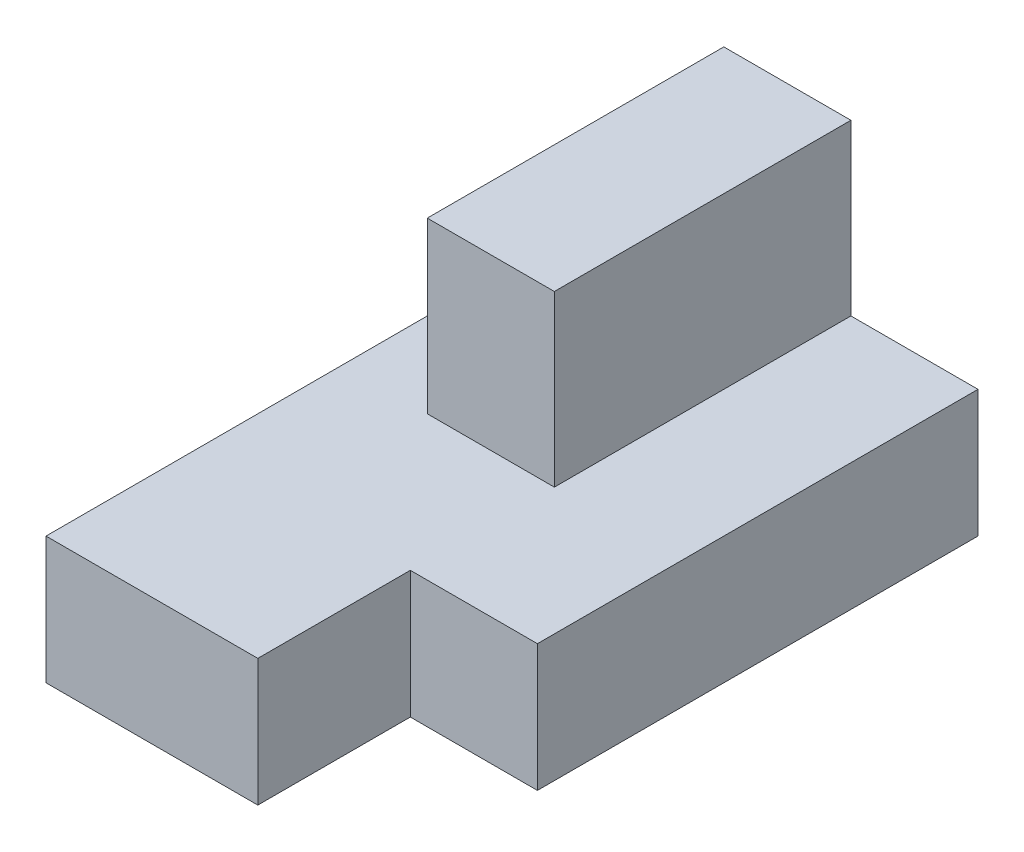
ISO-10303-21;
HEADER;
FILE_DESCRIPTION(('STEP AP214'),'2;1');
FILE_NAME('part.step','',(''),(''),'','','');
FILE_SCHEMA(('AUTOMOTIVE_DESIGN { 1 0 10303 214 1 1 1 1 }'));
ENDSEC;
DATA;
#1=APPLICATION_CONTEXT('core data for automotive mechanical design processes');
#2=APPLICATION_PROTOCOL_DEFINITION('international standard','automotive_design',2000,#1);
#3=PRODUCT_CONTEXT('',#1,'mechanical');
#4=PRODUCT('Part','Part','',(#3));
#5=PRODUCT_RELATED_PRODUCT_CATEGORY('part','',(#4));
#6=PRODUCT_DEFINITION_FORMATION('','',#4);
#7=PRODUCT_DEFINITION_CONTEXT('part definition',#1,'design');
#8=PRODUCT_DEFINITION('design','',#6,#7);
#9=PRODUCT_DEFINITION_SHAPE('','',#8);
#10=(LENGTH_UNIT() NAMED_UNIT(*) SI_UNIT(.MILLI.,.METRE.));
#11=(NAMED_UNIT(*) PLANE_ANGLE_UNIT() SI_UNIT($,.RADIAN.));
#12=(NAMED_UNIT(*) SI_UNIT($,.STERADIAN.) SOLID_ANGLE_UNIT());
#13=UNCERTAINTY_MEASURE_WITH_UNIT(LENGTH_MEASURE(1.E-05),#10,'distance_accuracy_value','');
#14=(GEOMETRIC_REPRESENTATION_CONTEXT(3) GLOBAL_UNCERTAINTY_ASSIGNED_CONTEXT((#13)) GLOBAL_UNIT_ASSIGNED_CONTEXT((#10,
#11,#12)) REPRESENTATION_CONTEXT('',''));
#15=CARTESIAN_POINT('',(0.,0.,0.));
#16=DIRECTION('',(0.,0.,1.));
#17=DIRECTION('',(1.,0.,0.));
#18=AXIS2_PLACEMENT_3D('',#15,#16,#17);
#19=CARTESIAN_POINT('',(-20.,15.,-35.));
#20=DIRECTION('',(1.,0.,0.));
#21=DIRECTION('',(0.,0.,-1.));
#22=AXIS2_PLACEMENT_3D('',#19,#20,#21);
#23=PLANE('',#22);
#24=DIRECTION('',(0.,0.,1.));
#25=VECTOR('',#24,1.);
#26=CARTESIAN_POINT('',(-20.,0.,-35.));
#27=LINE('',#26,#25);
#28=CARTESIAN_POINT('',(-20.,0.,-35.));
#29=VERTEX_POINT('',#28);
#30=CARTESIAN_POINT('',(-20.,0.,35.));
#31=VERTEX_POINT('',#30);
#32=EDGE_CURVE('E129',#29,#31,#27,.T.);
#33=ORIENTED_EDGE('',*,*,#32,.T.);
#34=DIRECTION('',(0.,-1.,0.));
#35=VECTOR('',#34,1.);
#36=CARTESIAN_POINT('',(-20.,15.,35.));
#37=LINE('',#36,#35);
#38=CARTESIAN_POINT('',(-20.,15.,35.));
#39=VERTEX_POINT('',#38);
#40=EDGE_CURVE('E11',#39,#31,#37,.T.);
#41=ORIENTED_EDGE('',*,*,#40,.F.);
#42=DIRECTION('',(0.,0.,1.));
#43=VECTOR('',#42,1.);
#44=CARTESIAN_POINT('',(-20.,15.,-35.));
#45=LINE('',#44,#43);
#46=CARTESIAN_POINT('',(-20.,15.,-35.));
#47=VERTEX_POINT('',#46);
#48=EDGE_CURVE('E138',#47,#39,#45,.T.);
#49=ORIENTED_EDGE('',*,*,#48,.F.);
#50=DIRECTION('',(0.,-1.,0.));
#51=VECTOR('',#50,1.);
#52=CARTESIAN_POINT('',(-20.,15.,-35.));
#53=LINE('',#52,#51);
#54=EDGE_CURVE('E152',#47,#29,#53,.T.);
#55=ORIENTED_EDGE('',*,*,#54,.T.);
#56=EDGE_LOOP('',(#33,#41,#49,#55));
#57=FACE_BOUND('',#56,.T.);
#58=ADVANCED_FACE('F33',(#57),#23,.F.);
#59=CARTESIAN_POINT('',(-20.,15.,35.));
#60=DIRECTION('',(0.,0.,-1.));
#61=DIRECTION('',(-1.,0.,0.));
#62=AXIS2_PLACEMENT_3D('',#59,#60,#61);
#63=PLANE('',#62);
#64=DIRECTION('',(1.,0.,0.));
#65=VECTOR('',#64,1.);
#66=CARTESIAN_POINT('',(-20.,0.,35.));
#67=LINE('',#66,#65);
#68=CARTESIAN_POINT('',(5.,0.,35.));
#69=VERTEX_POINT('',#68);
#70=EDGE_CURVE('E132',#31,#69,#67,.T.);
#71=ORIENTED_EDGE('',*,*,#70,.T.);
#72=DIRECTION('',(0.,-1.,0.));
#73=VECTOR('',#72,1.);
#74=CARTESIAN_POINT('',(5.,15.,35.));
#75=LINE('',#74,#73);
#76=CARTESIAN_POINT('',(5.,15.,35.));
#77=VERTEX_POINT('',#76);
#78=EDGE_CURVE('E40',#77,#69,#75,.T.);
#79=ORIENTED_EDGE('',*,*,#78,.F.);
#80=DIRECTION('',(1.,0.,0.));
#81=VECTOR('',#80,1.);
#82=CARTESIAN_POINT('',(-20.,15.,35.));
#83=LINE('',#82,#81);
#84=EDGE_CURVE('E141',#39,#77,#83,.T.);
#85=ORIENTED_EDGE('',*,*,#84,.F.);
#86=ORIENTED_EDGE('',*,*,#40,.T.);
#87=EDGE_LOOP('',(#71,#79,#85,#86));
#88=FACE_BOUND('',#87,.T.);
#89=ADVANCED_FACE('F199',(#88),#63,.F.);
#90=CARTESIAN_POINT('',(5.,15.,35.));
#91=DIRECTION('',(-1.,0.,0.));
#92=DIRECTION('',(0.,0.,1.));
#93=AXIS2_PLACEMENT_3D('',#90,#91,#92);
#94=PLANE('',#93);
#95=DIRECTION('',(0.,0.,-1.));
#96=VECTOR('',#95,1.);
#97=CARTESIAN_POINT('',(5.,0.,35.));
#98=LINE('',#97,#96);
#99=CARTESIAN_POINT('',(5.,0.,17.));
#100=VERTEX_POINT('',#99);
#101=EDGE_CURVE('E155',#69,#100,#98,.T.);
#102=ORIENTED_EDGE('',*,*,#101,.T.);
#103=DIRECTION('',(0.,-1.,0.));
#104=VECTOR('',#103,1.);
#105=CARTESIAN_POINT('',(5.,15.,17.));
#106=LINE('',#105,#104);
#107=CARTESIAN_POINT('',(5.,15.,17.));
#108=VERTEX_POINT('',#107);
#109=EDGE_CURVE('E170',#108,#100,#106,.T.);
#110=ORIENTED_EDGE('',*,*,#109,.F.);
#111=DIRECTION('',(0.,0.,-1.));
#112=VECTOR('',#111,1.);
#113=CARTESIAN_POINT('',(5.,15.,35.));
#114=LINE('',#113,#112);
#115=EDGE_CURVE('E144',#77,#108,#114,.T.);
#116=ORIENTED_EDGE('',*,*,#115,.F.);
#117=ORIENTED_EDGE('',*,*,#78,.T.);
#118=EDGE_LOOP('',(#102,#110,#116,#117));
#119=FACE_BOUND('',#118,.T.);
#120=ADVANCED_FACE('F177',(#119),#94,.F.);
#121=CARTESIAN_POINT('',(5.,15.,17.));
#122=DIRECTION('',(0.,0.,-1.));
#123=DIRECTION('',(-1.,0.,0.));
#124=AXIS2_PLACEMENT_3D('',#121,#122,#123);
#125=PLANE('',#124);
#126=DIRECTION('',(1.,0.,0.));
#127=VECTOR('',#126,1.);
#128=CARTESIAN_POINT('',(5.,0.,17.));
#129=LINE('',#128,#127);
#130=CARTESIAN_POINT('',(20.,0.,17.));
#131=VERTEX_POINT('',#130);
#132=EDGE_CURVE('E157',#100,#131,#129,.T.);
#133=ORIENTED_EDGE('',*,*,#132,.T.);
#134=DIRECTION('',(0.,-1.,0.));
#135=VECTOR('',#134,1.);
#136=CARTESIAN_POINT('',(20.,15.,17.));
#137=LINE('',#136,#135);
#138=CARTESIAN_POINT('',(20.,15.,17.));
#139=VERTEX_POINT('',#138);
#140=EDGE_CURVE('E167',#139,#131,#137,.T.);
#141=ORIENTED_EDGE('',*,*,#140,.F.);
#142=DIRECTION('',(1.,0.,0.));
#143=VECTOR('',#142,1.);
#144=CARTESIAN_POINT('',(5.,15.,17.));
#145=LINE('',#144,#143);
#146=EDGE_CURVE('E146',#108,#139,#145,.T.);
#147=ORIENTED_EDGE('',*,*,#146,.F.);
#148=ORIENTED_EDGE('',*,*,#109,.T.);
#149=EDGE_LOOP('',(#133,#141,#147,#148));
#150=FACE_BOUND('',#149,.T.);
#151=ADVANCED_FACE('F188',(#150),#125,.F.);
#152=CARTESIAN_POINT('',(20.,15.,-35.));
#153=DIRECTION('',(-1.,0.,0.));
#154=DIRECTION('',(0.,0.,1.));
#155=AXIS2_PLACEMENT_3D('',#152,#153,#154);
#156=PLANE('',#155);
#157=DIRECTION('',(0.,0.,-1.));
#158=VECTOR('',#157,1.);
#159=CARTESIAN_POINT('',(20.,0.,-35.));
#160=LINE('',#159,#158);
#161=CARTESIAN_POINT('',(20.,0.,-35.));
#162=VERTEX_POINT('',#161);
#163=EDGE_CURVE('E159',#131,#162,#160,.T.);
#164=ORIENTED_EDGE('',*,*,#163,.T.);
#165=DIRECTION('',(0.,-1.,0.));
#166=VECTOR('',#165,1.);
#167=CARTESIAN_POINT('',(20.,15.,-35.));
#168=LINE('',#167,#166);
#169=CARTESIAN_POINT('',(20.,15.,-35.));
#170=VERTEX_POINT('',#169);
#171=EDGE_CURVE('E164',#170,#162,#168,.T.);
#172=ORIENTED_EDGE('',*,*,#171,.F.);
#173=DIRECTION('',(0.,0.,-1.));
#174=VECTOR('',#173,1.);
#175=CARTESIAN_POINT('',(20.,15.,-35.));
#176=LINE('',#175,#174);
#177=EDGE_CURVE('E148',#139,#170,#176,.T.);
#178=ORIENTED_EDGE('',*,*,#177,.F.);
#179=ORIENTED_EDGE('',*,*,#140,.T.);
#180=EDGE_LOOP('',(#164,#172,#178,#179));
#181=FACE_BOUND('',#180,.T.);
#182=ADVANCED_FACE('F192',(#181),#156,.F.);
#183=CARTESIAN_POINT('',(-20.,15.,-35.));
#184=DIRECTION('',(0.,0.,1.));
#185=DIRECTION('',(1.,0.,0.));
#186=AXIS2_PLACEMENT_3D('',#183,#184,#185);
#187=PLANE('',#186);
#188=DIRECTION('',(-1.,0.,0.));
#189=VECTOR('',#188,1.);
#190=CARTESIAN_POINT('',(-20.,0.,-35.));
#191=LINE('',#190,#189);
#192=EDGE_CURVE('E142',#162,#29,#191,.T.);
#193=ORIENTED_EDGE('',*,*,#192,.T.);
#194=ORIENTED_EDGE('',*,*,#54,.F.);
#195=DIRECTION('',(-1.,0.,0.));
#196=VECTOR('',#195,1.);
#197=CARTESIAN_POINT('',(-20.,15.,-35.));
#198=LINE('',#197,#196);
#199=CARTESIAN_POINT('',(-9.99999999999999,15.,-35.));
#200=VERTEX_POINT('',#199);
#201=EDGE_CURVE('E150',#200,#47,#198,.T.);
#202=ORIENTED_EDGE('',*,*,#201,.F.);
#203=DIRECTION('',(0.,-1.,0.));
#204=VECTOR('',#203,1.);
#205=CARTESIAN_POINT('',(-9.99999999999999,35.,-35.));
#206=LINE('',#205,#204);
#207=CARTESIAN_POINT('',(-9.99999999999999,35.,-35.));
#208=VERTEX_POINT('',#207);
#209=EDGE_CURVE('E207',#208,#200,#206,.T.);
#210=ORIENTED_EDGE('',*,*,#209,.F.);
#211=DIRECTION('',(-1.,0.,0.));
#212=VECTOR('',#211,1.);
#213=CARTESIAN_POINT('',(-9.99999999999999,35.,-35.));
#214=LINE('',#213,#212);
#215=CARTESIAN_POINT('',(5.,35.,-35.));
#216=VERTEX_POINT('',#215);
#217=EDGE_CURVE('E122',#216,#208,#214,.T.);
#218=ORIENTED_EDGE('',*,*,#217,.F.);
#219=DIRECTION('',(0.,-1.,0.));
#220=VECTOR('',#219,1.);
#221=CARTESIAN_POINT('',(5.,35.,-35.));
#222=LINE('',#221,#220);
#223=CARTESIAN_POINT('',(5.,15.,-35.));
#224=VERTEX_POINT('',#223);
#225=EDGE_CURVE('E134',#216,#224,#222,.T.);
#226=ORIENTED_EDGE('',*,*,#225,.T.);
#227=EDGE_CURVE('E151',#170,#224,#198,.T.);
#228=ORIENTED_EDGE('',*,*,#227,.F.);
#229=ORIENTED_EDGE('',*,*,#171,.T.);
#230=EDGE_LOOP('',(#193,#194,#202,#210,#218,#226,#228,#229));
#231=FACE_BOUND('',#230,.T.);
#232=ADVANCED_FACE('F203',(#231),#187,.F.);
#233=CARTESIAN_POINT('',(0.,15.,0.));
#234=DIRECTION('',(0.,1.,0.));
#235=DIRECTION('',(0.,0.,1.));
#236=AXIS2_PLACEMENT_3D('',#233,#234,#235);
#237=PLANE('',#236);
#238=DIRECTION('',(0.,0.,1.));
#239=VECTOR('',#238,1.);
#240=CARTESIAN_POINT('',(-9.99999999999999,15.,-35.));
#241=LINE('',#240,#239);
#242=CARTESIAN_POINT('',(-9.99999999999999,15.,0.));
#243=VERTEX_POINT('',#242);
#244=EDGE_CURVE('E52',#200,#243,#241,.T.);
#245=ORIENTED_EDGE('',*,*,#244,.F.);
#246=ORIENTED_EDGE('',*,*,#201,.T.);
#247=ORIENTED_EDGE('',*,*,#48,.T.);
#248=ORIENTED_EDGE('',*,*,#84,.T.);
#249=ORIENTED_EDGE('',*,*,#115,.T.);
#250=ORIENTED_EDGE('',*,*,#146,.T.);
#251=ORIENTED_EDGE('',*,*,#177,.T.);
#252=ORIENTED_EDGE('',*,*,#227,.T.);
#253=DIRECTION('',(0.,0.,-1.));
#254=VECTOR('',#253,1.);
#255=CARTESIAN_POINT('',(5.,15.,-35.));
#256=LINE('',#255,#254);
#257=CARTESIAN_POINT('',(5.00000000000001,15.,0.));
#258=VERTEX_POINT('',#257);
#259=EDGE_CURVE('E126',#258,#224,#256,.T.);
#260=ORIENTED_EDGE('',*,*,#259,.F.);
#261=DIRECTION('',(1.,0.,0.));
#262=VECTOR('',#261,1.);
#263=CARTESIAN_POINT('',(-9.99999999999999,15.,0.));
#264=LINE('',#263,#262);
#265=EDGE_CURVE('E47',#243,#258,#264,.T.);
#266=ORIENTED_EDGE('',*,*,#265,.F.);
#267=EDGE_LOOP('',(#245,#246,#247,#248,#249,#250,#251,#252,#260,#266));
#268=FACE_BOUND('',#267,.T.);
#269=ADVANCED_FACE('F195',(#268),#237,.T.);
#270=CARTESIAN_POINT('',(0.,0.,0.));
#271=DIRECTION('',(0.,1.,0.));
#272=DIRECTION('',(0.,0.,1.));
#273=AXIS2_PLACEMENT_3D('',#270,#271,#272);
#274=PLANE('',#273);
#275=ORIENTED_EDGE('',*,*,#32,.F.);
#276=ORIENTED_EDGE('',*,*,#192,.F.);
#277=ORIENTED_EDGE('',*,*,#163,.F.);
#278=ORIENTED_EDGE('',*,*,#132,.F.);
#279=ORIENTED_EDGE('',*,*,#101,.F.);
#280=ORIENTED_EDGE('',*,*,#70,.F.);
#281=EDGE_LOOP('',(#275,#276,#277,#278,#279,#280));
#282=FACE_BOUND('',#281,.T.);
#283=ADVANCED_FACE('F183',(#282),#274,.F.);
#284=CARTESIAN_POINT('',(-9.99999999999999,35.,-35.));
#285=DIRECTION('',(1.,0.,0.));
#286=DIRECTION('',(0.,0.,-1.));
#287=AXIS2_PLACEMENT_3D('',#284,#285,#286);
#288=PLANE('',#287);
#289=ORIENTED_EDGE('',*,*,#244,.T.);
#290=DIRECTION('',(0.,-1.,0.));
#291=VECTOR('',#290,1.);
#292=CARTESIAN_POINT('',(-9.99999999999999,35.,0.));
#293=LINE('',#292,#291);
#294=CARTESIAN_POINT('',(-9.99999999999999,35.,0.));
#295=VERTEX_POINT('',#294);
#296=EDGE_CURVE('E111',#295,#243,#293,.T.);
#297=ORIENTED_EDGE('',*,*,#296,.F.);
#298=DIRECTION('',(0.,0.,1.));
#299=VECTOR('',#298,1.);
#300=CARTESIAN_POINT('',(-9.99999999999999,35.,-35.));
#301=LINE('',#300,#299);
#302=EDGE_CURVE('E117',#208,#295,#301,.T.);
#303=ORIENTED_EDGE('',*,*,#302,.F.);
#304=ORIENTED_EDGE('',*,*,#209,.T.);
#305=EDGE_LOOP('',(#289,#297,#303,#304));
#306=FACE_BOUND('',#305,.T.);
#307=ADVANCED_FACE('F128',(#306),#288,.F.);
#308=CARTESIAN_POINT('',(-9.99999999999999,35.,0.));
#309=DIRECTION('',(0.,0.,-1.));
#310=DIRECTION('',(-1.,0.,0.));
#311=AXIS2_PLACEMENT_3D('',#308,#309,#310);
#312=PLANE('',#311);
#313=ORIENTED_EDGE('',*,*,#265,.T.);
#314=DIRECTION('',(0.,-1.,0.));
#315=VECTOR('',#314,1.);
#316=CARTESIAN_POINT('',(5.00000000000001,35.,0.));
#317=LINE('',#316,#315);
#318=CARTESIAN_POINT('',(5.00000000000001,35.,0.));
#319=VERTEX_POINT('',#318);
#320=EDGE_CURVE('E113',#319,#258,#317,.T.);
#321=ORIENTED_EDGE('',*,*,#320,.F.);
#322=DIRECTION('',(1.,0.,0.));
#323=VECTOR('',#322,1.);
#324=CARTESIAN_POINT('',(-9.99999999999999,35.,0.));
#325=LINE('',#324,#323);
#326=EDGE_CURVE('E107',#295,#319,#325,.T.);
#327=ORIENTED_EDGE('',*,*,#326,.F.);
#328=ORIENTED_EDGE('',*,*,#296,.T.);
#329=EDGE_LOOP('',(#313,#321,#327,#328));
#330=FACE_BOUND('',#329,.T.);
#331=ADVANCED_FACE('F109',(#330),#312,.F.);
#332=CARTESIAN_POINT('',(5.,35.,-35.));
#333=DIRECTION('',(-1.,0.,0.));
#334=DIRECTION('',(0.,0.,1.));
#335=AXIS2_PLACEMENT_3D('',#332,#333,#334);
#336=PLANE('',#335);
#337=ORIENTED_EDGE('',*,*,#259,.T.);
#338=ORIENTED_EDGE('',*,*,#225,.F.);
#339=DIRECTION('',(0.,0.,-1.));
#340=VECTOR('',#339,1.);
#341=CARTESIAN_POINT('',(5.,35.,-35.));
#342=LINE('',#341,#340);
#343=EDGE_CURVE('E116',#319,#216,#342,.T.);
#344=ORIENTED_EDGE('',*,*,#343,.F.);
#345=ORIENTED_EDGE('',*,*,#320,.T.);
#346=EDGE_LOOP('',(#337,#338,#344,#345));
#347=FACE_BOUND('',#346,.T.);
#348=ADVANCED_FACE('F214',(#347),#336,.F.);
#349=CARTESIAN_POINT('',(0.,35.,0.));
#350=DIRECTION('',(0.,1.,0.));
#351=DIRECTION('',(0.,0.,1.));
#352=AXIS2_PLACEMENT_3D('',#349,#350,#351);
#353=PLANE('',#352);
#354=ORIENTED_EDGE('',*,*,#302,.T.);
#355=ORIENTED_EDGE('',*,*,#326,.T.);
#356=ORIENTED_EDGE('',*,*,#343,.T.);
#357=ORIENTED_EDGE('',*,*,#217,.T.);
#358=EDGE_LOOP('',(#354,#355,#356,#357));
#359=FACE_BOUND('',#358,.T.);
#360=ADVANCED_FACE('F120',(#359),#353,.T.);
#361=CLOSED_SHELL('',(#58,#89,#120,#151,#182,#232,#269,#283,#307,#331,#348,#360));
#362=MANIFOLD_SOLID_BREP('B2',#361);
#363=ADVANCED_BREP_SHAPE_REPRESENTATION('',(#18,#362),#14);
#364=SHAPE_DEFINITION_REPRESENTATION(#9,#363);
ENDSEC;
END-ISO-10303-21;
